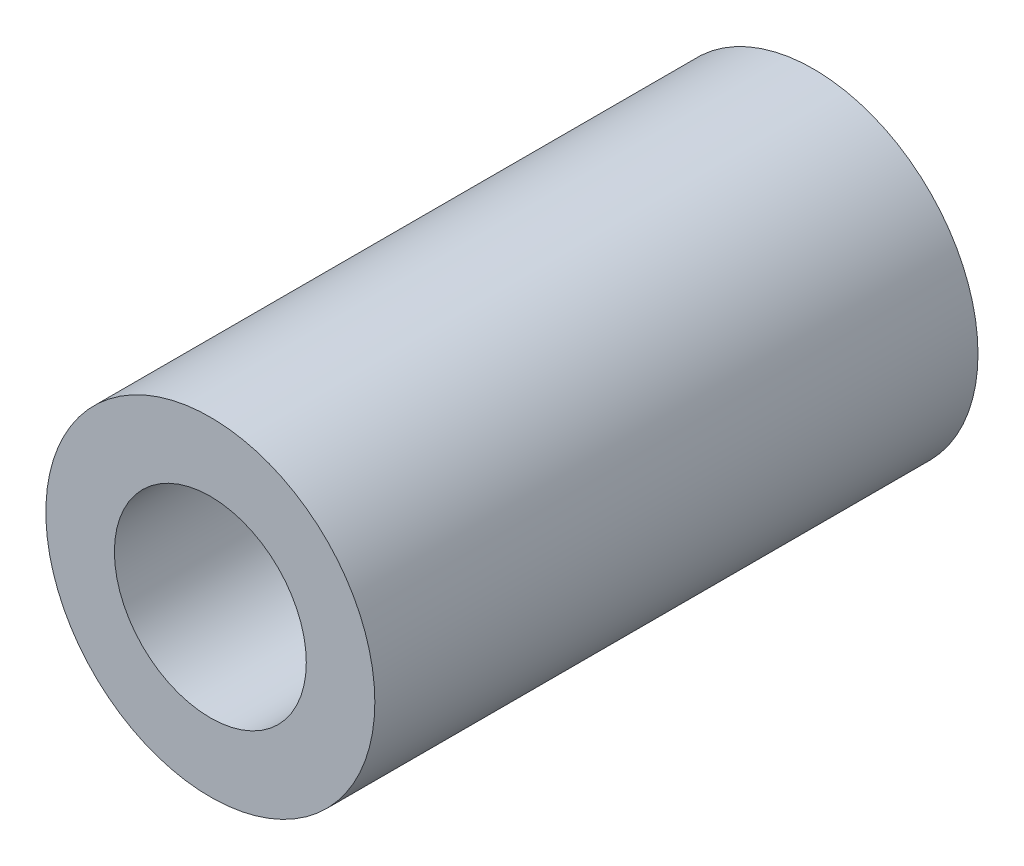
ISO-10303-21;
HEADER;
FILE_DESCRIPTION(('STEP AP214'),'2;1');
FILE_NAME('part.step','',(''),(''),'','','');
FILE_SCHEMA(('AUTOMOTIVE_DESIGN { 1 0 10303 214 1 1 1 1 }'));
ENDSEC;
DATA;
#1=APPLICATION_CONTEXT('core data for automotive mechanical design processes');
#2=APPLICATION_PROTOCOL_DEFINITION('international standard','automotive_design',2000,#1);
#3=PRODUCT_CONTEXT('',#1,'mechanical');
#4=PRODUCT('Part','Part','',(#3));
#5=PRODUCT_RELATED_PRODUCT_CATEGORY('part','',(#4));
#6=PRODUCT_DEFINITION_FORMATION('','',#4);
#7=PRODUCT_DEFINITION_CONTEXT('part definition',#1,'design');
#8=PRODUCT_DEFINITION('design','',#6,#7);
#9=PRODUCT_DEFINITION_SHAPE('','',#8);
#10=(LENGTH_UNIT() NAMED_UNIT(*) SI_UNIT(.MILLI.,.METRE.));
#11=(NAMED_UNIT(*) PLANE_ANGLE_UNIT() SI_UNIT($,.RADIAN.));
#12=(NAMED_UNIT(*) SI_UNIT($,.STERADIAN.) SOLID_ANGLE_UNIT());
#13=UNCERTAINTY_MEASURE_WITH_UNIT(LENGTH_MEASURE(1.E-05),#10,'distance_accuracy_value','');
#14=(GEOMETRIC_REPRESENTATION_CONTEXT(3) GLOBAL_UNCERTAINTY_ASSIGNED_CONTEXT((#13)) GLOBAL_UNIT_ASSIGNED_CONTEXT((#10,
#11,#12)) REPRESENTATION_CONTEXT('',''));
#15=CARTESIAN_POINT('',(0.,0.,0.));
#16=DIRECTION('',(0.,0.,1.));
#17=DIRECTION('',(1.,0.,0.));
#18=AXIS2_PLACEMENT_3D('',#15,#16,#17);
#19=CARTESIAN_POINT('',(0.,0.,11.));
#20=DIRECTION('',(0.,0.,1.));
#21=DIRECTION('',(1.,0.,0.));
#22=AXIS2_PLACEMENT_3D('',#19,#20,#21);
#23=PLANE('',#22);
#24=CARTESIAN_POINT('',(0.,0.,11.));
#25=DIRECTION('',(0.,0.,1.));
#26=DIRECTION('',(1.,0.,0.));
#27=AXIS2_PLACEMENT_3D('',#24,#25,#26);
#28=CIRCLE('',#27,3.);
#29=CARTESIAN_POINT('',(3.,0.,11.));
#30=VERTEX_POINT('',#29);
#31=EDGE_CURVE('E10',#30,#30,#28,.T.);
#32=ORIENTED_EDGE('',*,*,#31,.T.);
#33=EDGE_LOOP('',(#32));
#34=FACE_BOUND('',#33,.T.);
#35=CARTESIAN_POINT('',(0.,0.,11.));
#36=DIRECTION('',(0.,0.,1.));
#37=DIRECTION('',(1.,0.,0.));
#38=AXIS2_PLACEMENT_3D('',#35,#36,#37);
#39=CIRCLE('',#38,1.75);
#40=CARTESIAN_POINT('',(1.75,0.,11.));
#41=VERTEX_POINT('',#40);
#42=EDGE_CURVE('E43',#41,#41,#39,.T.);
#43=ORIENTED_EDGE('',*,*,#42,.F.);
#44=EDGE_LOOP('',(#43));
#45=FACE_BOUND('',#44,.T.);
#46=ADVANCED_FACE('F32',(#34,#45),#23,.T.);
#47=CARTESIAN_POINT('',(0.,0.,0.));
#48=DIRECTION('',(0.,0.,1.));
#49=DIRECTION('',(1.,0.,0.));
#50=AXIS2_PLACEMENT_3D('',#47,#48,#49);
#51=PLANE('',#50);
#52=CARTESIAN_POINT('',(0.,0.,0.));
#53=DIRECTION('',(0.,0.,1.));
#54=DIRECTION('',(1.,0.,0.));
#55=AXIS2_PLACEMENT_3D('',#52,#53,#54);
#56=CIRCLE('',#55,3.);
#57=CARTESIAN_POINT('',(3.,0.,0.));
#58=VERTEX_POINT('',#57);
#59=EDGE_CURVE('E36',#58,#58,#56,.T.);
#60=ORIENTED_EDGE('',*,*,#59,.F.);
#61=EDGE_LOOP('',(#60));
#62=FACE_BOUND('',#61,.T.);
#63=CARTESIAN_POINT('',(0.,0.,0.));
#64=DIRECTION('',(0.,0.,1.));
#65=DIRECTION('',(1.,0.,0.));
#66=AXIS2_PLACEMENT_3D('',#63,#64,#65);
#67=CIRCLE('',#66,1.75);
#68=CARTESIAN_POINT('',(1.75,0.,0.));
#69=VERTEX_POINT('',#68);
#70=EDGE_CURVE('E45',#69,#69,#67,.T.);
#71=ORIENTED_EDGE('',*,*,#70,.T.);
#72=EDGE_LOOP('',(#71));
#73=FACE_BOUND('',#72,.T.);
#74=ADVANCED_FACE('F55',(#62,#73),#51,.F.);
#75=CARTESIAN_POINT('',(0.,0.,11.));
#76=DIRECTION('',(0.,0.,-1.));
#77=DIRECTION('',(-1.,0.,0.));
#78=AXIS2_PLACEMENT_3D('',#75,#76,#77);
#79=CYLINDRICAL_SURFACE('',#78,3.);
#80=ORIENTED_EDGE('',*,*,#31,.F.);
#81=EDGE_LOOP('',(#80));
#82=FACE_BOUND('',#81,.T.);
#83=ORIENTED_EDGE('',*,*,#59,.T.);
#84=EDGE_LOOP('',(#83));
#85=FACE_BOUND('',#84,.T.);
#86=ADVANCED_FACE('F34',(#82,#85),#79,.T.);
#87=CARTESIAN_POINT('',(0.,0.,11.));
#88=DIRECTION('',(0.,0.,-1.));
#89=DIRECTION('',(-1.,0.,0.));
#90=AXIS2_PLACEMENT_3D('',#87,#88,#89);
#91=CYLINDRICAL_SURFACE('',#90,1.75);
#92=ORIENTED_EDGE('',*,*,#42,.T.);
#93=EDGE_LOOP('',(#92));
#94=FACE_BOUND('',#93,.T.);
#95=ORIENTED_EDGE('',*,*,#70,.F.);
#96=EDGE_LOOP('',(#95));
#97=FACE_BOUND('',#96,.T.);
#98=ADVANCED_FACE('F51',(#94,#97),#91,.F.);
#99=CLOSED_SHELL('',(#46,#74,#86,#98));
#100=MANIFOLD_SOLID_BREP('B2',#99);
#101=ADVANCED_BREP_SHAPE_REPRESENTATION('',(#18,#100),#14);
#102=SHAPE_DEFINITION_REPRESENTATION(#9,#101);
ENDSEC;
END-ISO-10303-21;
